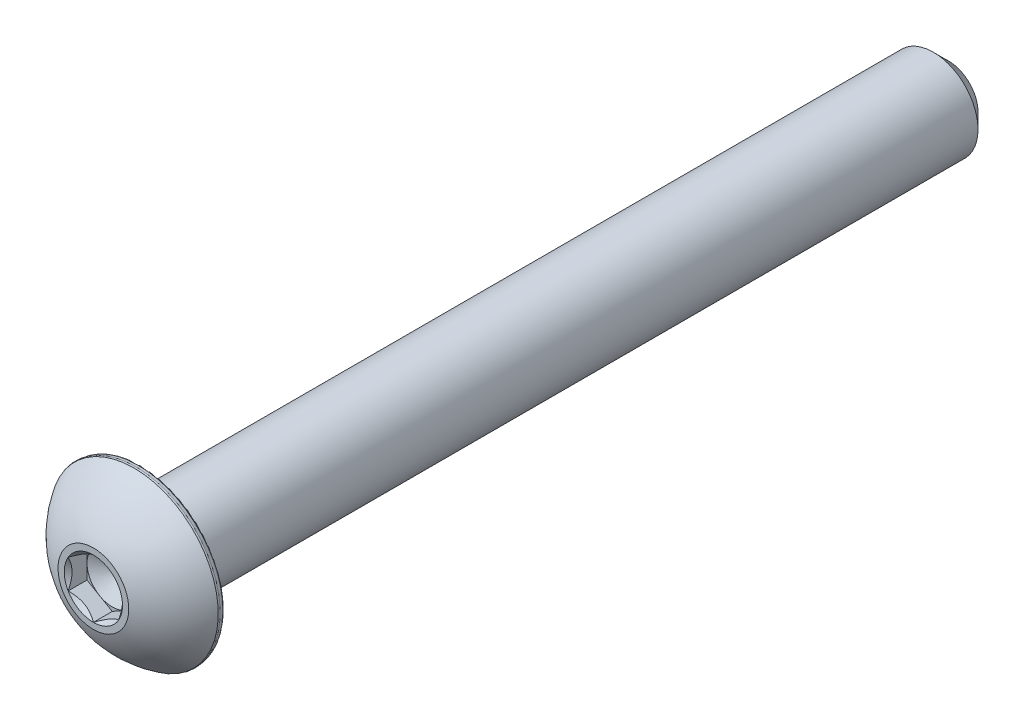
ISO-10303-21;
HEADER;
FILE_DESCRIPTION(('STEP AP214'),'2;1');
FILE_NAME('part.step','',(''),(''),'','','');
FILE_SCHEMA(('AUTOMOTIVE_DESIGN { 1 0 10303 214 1 1 1 1 }'));
ENDSEC;
DATA;
#1=APPLICATION_CONTEXT('core data for automotive mechanical design processes');
#2=APPLICATION_PROTOCOL_DEFINITION('international standard','automotive_design',2000,#1);
#3=PRODUCT_CONTEXT('',#1,'mechanical');
#4=PRODUCT('Part','Part','',(#3));
#5=PRODUCT_RELATED_PRODUCT_CATEGORY('part','',(#4));
#6=PRODUCT_DEFINITION_FORMATION('','',#4);
#7=PRODUCT_DEFINITION_CONTEXT('part definition',#1,'design');
#8=PRODUCT_DEFINITION('design','',#6,#7);
#9=PRODUCT_DEFINITION_SHAPE('','',#8);
#10=(LENGTH_UNIT() NAMED_UNIT(*) SI_UNIT(.MILLI.,.METRE.));
#11=(NAMED_UNIT(*) PLANE_ANGLE_UNIT() SI_UNIT($,.RADIAN.));
#12=(NAMED_UNIT(*) SI_UNIT($,.STERADIAN.) SOLID_ANGLE_UNIT());
#13=UNCERTAINTY_MEASURE_WITH_UNIT(LENGTH_MEASURE(1.E-05),#10,'distance_accuracy_value','');
#14=(GEOMETRIC_REPRESENTATION_CONTEXT(3) GLOBAL_UNCERTAINTY_ASSIGNED_CONTEXT((#13)) GLOBAL_UNIT_ASSIGNED_CONTEXT((#10,
#11,#12)) REPRESENTATION_CONTEXT('',''));
#15=CARTESIAN_POINT('',(0.,0.,0.));
#16=DIRECTION('',(0.,0.,1.));
#17=DIRECTION('',(1.,0.,0.));
#18=AXIS2_PLACEMENT_3D('',#15,#16,#17);
#19=CARTESIAN_POINT('',(0.,0.9921875,16.8021));
#20=DIRECTION('',(0.,0.,-1.));
#21=DIRECTION('',(-1.,0.,0.));
#22=AXIS2_PLACEMENT_3D('',#19,#20,#21);
#23=PLANE('',#22);
#24=CARTESIAN_POINT('',(0.,0.,16.8021));
#25=DIRECTION('',(0.,0.,1.));
#26=DIRECTION('',(1.,0.,0.));
#27=AXIS2_PLACEMENT_3D('',#24,#25,#26);
#28=CIRCLE('',#27,1.3890625);
#29=CARTESIAN_POINT('',(0.,1.3890625,16.8021));
#30=VERTEX_POINT('',#29);
#31=EDGE_CURVE('E173',#30,#30,#28,.T.);
#32=ORIENTED_EDGE('',*,*,#31,.T.);
#33=EDGE_LOOP('',(#32));
#34=FACE_BOUND('',#33,.T.);
#35=CARTESIAN_POINT('',(0.,0.,16.8021));
#36=DIRECTION('',(0.,0.,1.));
#37=DIRECTION('',(1.,0.,0.));
#38=AXIS2_PLACEMENT_3D('',#35,#36,#37);
#39=CIRCLE('',#38,1.14567944042316);
#40=CARTESIAN_POINT('',(0.,1.14567944042316,16.8021));
#41=VERTEX_POINT('',#40);
#42=CARTESIAN_POINT('',(-0.992187500000001,0.57283972021158,16.8021));
#43=VERTEX_POINT('',#42);
#44=EDGE_CURVE('E127',#41,#43,#39,.T.);
#45=ORIENTED_EDGE('',*,*,#44,.F.);
#46=CARTESIAN_POINT('',(0.,0.,16.8021));
#47=DIRECTION('',(0.,0.,1.));
#48=DIRECTION('',(1.,0.,0.));
#49=AXIS2_PLACEMENT_3D('',#46,#47,#48);
#50=CIRCLE('',#49,1.14567944042316);
#51=CARTESIAN_POINT('',(0.9921875,0.572839720211582,16.8021));
#52=VERTEX_POINT('',#51);
#53=EDGE_CURVE('E112',#52,#41,#50,.T.);
#54=ORIENTED_EDGE('',*,*,#53,.F.);
#55=CARTESIAN_POINT('',(0.,0.,16.8021));
#56=DIRECTION('',(0.,0.,1.));
#57=DIRECTION('',(1.,0.,0.));
#58=AXIS2_PLACEMENT_3D('',#55,#56,#57);
#59=CIRCLE('',#58,1.14567944042316);
#60=CARTESIAN_POINT('',(0.9921875,-0.572839720211582,16.8021));
#61=VERTEX_POINT('',#60);
#62=EDGE_CURVE('E123',#61,#52,#59,.T.);
#63=ORIENTED_EDGE('',*,*,#62,.F.);
#64=CARTESIAN_POINT('',(0.,0.,16.8021));
#65=DIRECTION('',(0.,0.,1.));
#66=DIRECTION('',(1.,0.,0.));
#67=AXIS2_PLACEMENT_3D('',#64,#65,#66);
#68=CIRCLE('',#67,1.14567944042316);
#69=CARTESIAN_POINT('',(0.,-1.14567944042316,16.8021));
#70=VERTEX_POINT('',#69);
#71=EDGE_CURVE('E144',#70,#61,#68,.T.);
#72=ORIENTED_EDGE('',*,*,#71,.F.);
#73=CARTESIAN_POINT('',(0.,0.,16.8021));
#74=DIRECTION('',(0.,0.,1.));
#75=DIRECTION('',(1.,0.,0.));
#76=AXIS2_PLACEMENT_3D('',#73,#74,#75);
#77=CIRCLE('',#76,1.14567944042316);
#78=CARTESIAN_POINT('',(-0.9921875,-0.572839720211582,16.8021));
#79=VERTEX_POINT('',#78);
#80=EDGE_CURVE('E490',#79,#70,#77,.T.);
#81=ORIENTED_EDGE('',*,*,#80,.F.);
#82=CARTESIAN_POINT('',(0.,0.,16.8021));
#83=DIRECTION('',(0.,0.,1.));
#84=DIRECTION('',(1.,0.,0.));
#85=AXIS2_PLACEMENT_3D('',#82,#83,#84);
#86=CIRCLE('',#85,1.14567944042316);
#87=EDGE_CURVE('E290',#43,#79,#86,.T.);
#88=ORIENTED_EDGE('',*,*,#87,.F.);
#89=EDGE_LOOP('',(#45,#54,#63,#72,#81,#88));
#90=FACE_BOUND('',#89,.T.);
#91=ADVANCED_FACE('F39',(#34,#90),#23,.F.);
#92=CARTESIAN_POINT('',(0.,0.,-16.8021));
#93=DIRECTION('',(0.,0.,1.));
#94=DIRECTION('',(1.,0.,0.));
#95=AXIS2_PLACEMENT_3D('',#92,#93,#94);
#96=CONICAL_SURFACE('',#95,1.1572875,0.785398163397447);
#97=CARTESIAN_POINT('',(0.,0.,-16.2067875));
#98=DIRECTION('',(0.,0.,1.));
#99=DIRECTION('',(1.,0.,0.));
#100=AXIS2_PLACEMENT_3D('',#97,#98,#99);
#101=CIRCLE('',#100,1.7526);
#102=CARTESIAN_POINT('',(1.7526,0.,-16.2067875));
#103=VERTEX_POINT('',#102);
#104=EDGE_CURVE('E180',#103,#103,#101,.T.);
#105=ORIENTED_EDGE('',*,*,#104,.F.);
#106=EDGE_LOOP('',(#105));
#107=FACE_BOUND('',#106,.T.);
#108=CARTESIAN_POINT('',(0.,0.,-16.8021));
#109=DIRECTION('',(0.,0.,1.));
#110=DIRECTION('',(1.,0.,0.));
#111=AXIS2_PLACEMENT_3D('',#108,#109,#110);
#112=CIRCLE('',#111,1.1572875);
#113=CARTESIAN_POINT('',(1.1572875,0.,-16.8021));
#114=VERTEX_POINT('',#113);
#115=EDGE_CURVE('E166',#114,#114,#112,.T.);
#116=ORIENTED_EDGE('',*,*,#115,.T.);
#117=EDGE_LOOP('',(#116));
#118=FACE_BOUND('',#117,.T.);
#119=ADVANCED_FACE('F217',(#107,#118),#96,.T.);
#120=CARTESIAN_POINT('',(0.,0.,16.8021));
#121=DIRECTION('',(0.,0.,1.));
#122=DIRECTION('',(1.,0.,0.));
#123=AXIS2_PLACEMENT_3D('',#120,#121,#122);
#124=CYLINDRICAL_SURFACE('',#123,1.7526);
#125=CARTESIAN_POINT('',(0.,0.,14.9479));
#126=DIRECTION('',(0.,0.,1.));
#127=DIRECTION('',(1.,0.,0.));
#128=AXIS2_PLACEMENT_3D('',#125,#126,#127);
#129=CIRCLE('',#128,1.7526);
#130=CARTESIAN_POINT('',(1.7526,0.,14.9479));
#131=VERTEX_POINT('',#130);
#132=EDGE_CURVE('E177',#131,#131,#129,.T.);
#133=ORIENTED_EDGE('',*,*,#132,.F.);
#134=EDGE_LOOP('',(#133));
#135=FACE_BOUND('',#134,.T.);
#136=ORIENTED_EDGE('',*,*,#104,.T.);
#137=EDGE_LOOP('',(#136));
#138=FACE_BOUND('',#137,.T.);
#139=ADVANCED_FACE('F224',(#135,#138),#124,.T.);
#140=CARTESIAN_POINT('',(0.,3.28741155973219,14.9479));
#141=DIRECTION('',(0.,0.,1.));
#142=DIRECTION('',(1.,0.,0.));
#143=AXIS2_PLACEMENT_3D('',#140,#141,#142);
#144=PLANE('',#143);
#145=CARTESIAN_POINT('',(0.,0.,14.9479));
#146=DIRECTION('',(0.,0.,1.));
#147=DIRECTION('',(1.,0.,0.));
#148=AXIS2_PLACEMENT_3D('',#145,#146,#147);
#149=CIRCLE('',#148,3.20961863292574);
#150=CARTESIAN_POINT('',(3.20961863292574,0.,14.9479));
#151=VERTEX_POINT('',#150);
#152=EDGE_CURVE('E47',#151,#151,#149,.F.);
#153=ORIENTED_EDGE('',*,*,#152,.T.);
#154=EDGE_LOOP('',(#153));
#155=FACE_BOUND('',#154,.T.);
#156=ORIENTED_EDGE('',*,*,#132,.T.);
#157=EDGE_LOOP('',(#156));
#158=FACE_BOUND('',#157,.T.);
#159=ADVANCED_FACE('F191',(#155,#158),#144,.F.);
#160=CARTESIAN_POINT('',(0.,0.,14.9479));
#161=DIRECTION('',(0.,0.,1.));
#162=DIRECTION('',(1.,0.,0.));
#163=AXIS2_PLACEMENT_3D('',#160,#161,#162);
#164=CONICAL_SURFACE('',#163,3.28741155973219,0.174532925199426);
#165=CARTESIAN_POINT('',(0.,0.,15.0245110774485));
#166=DIRECTION('',(0.,0.,-1.));
#167=DIRECTION('',(-1.,0.,0.));
#168=AXIS2_PLACEMENT_3D('',#165,#166,#167);
#169=CIRCLE('',#168,3.30092015970751);
#170=CARTESIAN_POINT('',(-3.30092015970751,0.,15.0245110774485));
#171=VERTEX_POINT('',#170);
#172=EDGE_CURVE('E186',#171,#171,#169,.F.);
#173=ORIENTED_EDGE('',*,*,#172,.T.);
#174=EDGE_LOOP('',(#173));
#175=FACE_BOUND('',#174,.T.);
#176=CARTESIAN_POINT('',(0.,0.,15.140362863037));
#177=DIRECTION('',(0.,0.,-1.));
#178=DIRECTION('',(-1.,0.,0.));
#179=AXIS2_PLACEMENT_3D('',#176,#177,#178);
#180=CIRCLE('',#179,3.32134795527);
#181=CARTESIAN_POINT('',(-3.32134795527,0.,15.140362863037));
#182=VERTEX_POINT('',#181);
#183=EDGE_CURVE('E183',#182,#182,#180,.T.);
#184=ORIENTED_EDGE('',*,*,#183,.T.);
#185=EDGE_LOOP('',(#184));
#186=FACE_BOUND('',#185,.T.);
#187=ADVANCED_FACE('F199',(#175,#186),#164,.T.);
#188=CARTESIAN_POINT('',(0.,0.,13.1796132454163));
#189=DIRECTION('',(0.,0.,1.));
#190=DIRECTION('',(0.,1.,0.));
#191=AXIS2_PLACEMENT_3D('',#188,#189,#190);
#192=SPHERICAL_SURFACE('',#191,3.87967845523838);
#193=CARTESIAN_POINT('',(0.,0.,15.204857654296));
#194=DIRECTION('',(0.,0.,-1.));
#195=DIRECTION('',(-1.,0.,0.));
#196=AXIS2_PLACEMENT_3D('',#193,#194,#195);
#197=CIRCLE('',#196,3.30912224016312);
#198=CARTESIAN_POINT('',(0.,3.30912224016311,15.204857654296));
#199=VERTEX_POINT('',#198);
#200=EDGE_CURVE('E11',#199,#199,#197,.F.);
#201=CARTESIAN_POINT('',(0.,3.30912224016311,15.204857654296));
#202=CARTESIAN_POINT('',(0.,3.29529526830407,15.2274501366691));
#203=CARTESIAN_POINT('',(0.,3.28123685957302,15.2499009736687));
#204=CARTESIAN_POINT('',(0.,3.25266321696502,15.2945100356743));
#205=CARTESIAN_POINT('',(0.,3.23814798308807,15.3166682606802));
#206=CARTESIAN_POINT('',(0.,3.2086667387864,15.3606827774513));
#207=CARTESIAN_POINT('',(0.,3.19370072836166,15.3825390692165));
#208=CARTESIAN_POINT('',(0.,3.16332422001081,15.4259405578101));
#209=CARTESIAN_POINT('',(0.,3.14791372208469,15.4474857546385));
#210=CARTESIAN_POINT('',(0.,3.11665470047967,15.4902560133525));
#211=CARTESIAN_POINT('',(0.,3.10080617680078,15.5114810752381));
#212=CARTESIAN_POINT('',(0.,3.06867775287599,15.5536021607178));
#213=CARTESIAN_POINT('',(0.,3.05239785263009,15.574498184312));
#214=CARTESIAN_POINT('',(0.,3.01941350473032,15.6159524272577));
#215=CARTESIAN_POINT('',(0.,3.00270905707646,15.6365106466093));
#216=CARTESIAN_POINT('',(0.,2.96888262188085,15.6772806569965));
#217=CARTESIAN_POINT('',(0.,2.95176063433909,15.697492448032));
#218=CARTESIAN_POINT('',(0.,2.91710630197352,15.7375611229935));
#219=CARTESIAN_POINT('',(0.,2.89957395714971,15.7574180069194));
#220=CARTESIAN_POINT('',(0.,2.86410626498847,15.796768537763));
#221=CARTESIAN_POINT('',(0.,2.84617091765105,15.8162621846806));
#222=CARTESIAN_POINT('',(0.,2.80990474428426,15.8548780639822));
#223=CARTESIAN_POINT('',(0.,2.79157391825489,15.8740002963661));
#224=CARTESIAN_POINT('',(0.,2.75452447722933,15.9118653248832));
#225=CARTESIAN_POINT('',(0.,2.73580586223313,15.9306081210163));
#226=CARTESIAN_POINT('',(0.,2.69798869567494,15.9677064144867));
#227=CARTESIAN_POINT('',(0.,2.67889014411294,15.986061911824));
#228=CARTESIAN_POINT('',(0.,2.64032111620648,16.0223779076283));
#229=CARTESIAN_POINT('',(0.,2.62085063986202,16.0403384060953));
#230=CARTESIAN_POINT('',(0.,2.58154593019523,16.0758568697855));
#231=CARTESIAN_POINT('',(0.,2.56171169687291,16.0934148350087));
#232=CARTESIAN_POINT('',(0.,2.52168779364995,16.1281208666993));
#233=CARTESIAN_POINT('',(0.,2.50149812374931,16.1452689331666));
#234=CARTESIAN_POINT('',(0.,2.46077181687379,16.1791479737844));
#235=CARTESIAN_POINT('',(0.,2.44023517989892,16.195878947935));
#236=CARTESIAN_POINT('',(0.,2.39882355393063,16.2289167853274));
#237=CARTESIAN_POINT('',(0.,2.37794856493723,16.2452236485693));
#238=CARTESIAN_POINT('',(0.,2.3358689919252,16.2774064234657));
#239=CARTESIAN_POINT('',(0.,2.31466440790658,16.2932823351202));
#240=CARTESIAN_POINT('',(0.,2.27193454010156,16.324596546946));
#241=CARTESIAN_POINT('',(0.,2.25040925631515,16.3400348471172));
#242=CARTESIAN_POINT('',(0.,2.20704701876452,16.3704673596574));
#243=CARTESIAN_POINT('',(0.,2.18521006500029,16.3854615720263));
#244=CARTESIAN_POINT('',(0.,2.14123364802863,16.414999618936));
#245=CARTESIAN_POINT('',(0.,2.11909418482119,16.4295434534768));
#246=CARTESIAN_POINT('',(0.,2.07452203639932,16.4581746436365));
#247=CARTESIAN_POINT('',(0.,2.05208935118488,16.4722619992554));
#248=CARTESIAN_POINT('',(0.,2.00694016919158,16.4999743219702));
#249=CARTESIAN_POINT('',(0.,1.9842236724127,16.5135992890662));
#250=CARTESIAN_POINT('',(0.,1.93851639678886,16.5403811190992));
#251=CARTESIAN_POINT('',(0.,1.91552561794389,16.5535379820363));
#252=CARTESIAN_POINT('',(0.,1.86927942275519,16.5793780845047));
#253=CARTESIAN_POINT('',(0.,1.84602400641147,16.5920613240361));
#254=CARTESIAN_POINT('',(0.,1.79925829177545,16.6169488590519));
#255=CARTESIAN_POINT('',(0.,1.77574799348315,16.6291531545362));
#256=CARTESIAN_POINT('',(0.,1.7284823775409,16.6530776820234));
#257=CARTESIAN_POINT('',(0.,1.70472705989094,16.6647979140262));
#258=CARTESIAN_POINT('',(0.,1.65698137016677,16.6877493970921));
#259=CARTESIAN_POINT('',(0.,1.63299099809256,16.6989806481553));
#260=CARTESIAN_POINT('',(0.,1.58478526470882,16.7209494610651));
#261=CARTESIAN_POINT('',(0.,1.56056990339929,16.7316870229116));
#262=CARTESIAN_POINT('',(0.,1.5119243449548,16.7526639410789));
#263=CARTESIAN_POINT('',(0.,1.48749414781984,16.7629032973996));
#264=CARTESIAN_POINT('',(0.,1.43842918425175,16.7828795536797));
#265=CARTESIAN_POINT('',(0.,1.41379441781861,16.792616453639));
#266=CARTESIAN_POINT('',(0.,1.3890625,16.8021));
#267=B_SPLINE_CURVE_WITH_KNOTS('',3,(#201,#202,#203,#204,#205,#206,#207,#208,#209,#210,#211,
#212,#213,#214,#215,#216,#217,#218,#219,#220,#221,#222,#223,#224,#225,#226,#227,#228,#229,#230,
#231,#232,#233,#234,#235,#236,#237,#238,#239,#240,#241,#242,#243,#244,#245,#246,#247,#248,#249,
#250,#251,#252,#253,#254,#255,#256,#257,#258,#259,#260,#261,#262,#263,#264,#265,#266),
.UNSPECIFIED.,.F.,.F.,(4,2,2,2,2,2,2,2,2,2,2,2,2,2,2,2,2,2,2,2,2,2,2,2,2,2,2,2,2,2,2,2,4),(0.,
0.0794621140090885,0.158924228018176,0.238386342027264,0.317848456036352,0.39731057004544,
0.476772684054528,0.556234798063618,0.635696912072705,0.715159026081794,0.794621140090881,
0.87408325409997,0.953545368109059,1.03300748211815,1.11246959612724,1.19193171013632,
1.27139382414541,1.3508559381545,1.43031805216359,1.50978016617268,1.58924228018177,
1.66870439419085,1.74816650819994,1.82762862220903,1.90709073621812,1.98655285022721,
2.06601496423629,2.14547707824538,2.22493919225447,2.30440130626356,2.38386342027265,
2.46332553428174,2.54278764829082),.UNSPECIFIED.);
#268=EDGE_CURVE('BSEAM202',#199,#30,#267,.T.);
#269=ORIENTED_EDGE('',*,*,#200,.T.);
#270=ORIENTED_EDGE('',*,*,#31,.F.);
#271=ORIENTED_EDGE('',*,*,#268,.T.);
#272=ORIENTED_EDGE('',*,*,#268,.F.);
#273=EDGE_LOOP('',(#269,#271,#270,#272));
#274=FACE_BOUND('',#273,.T.);
#275=ADVANCED_FACE('F202',(#274),#192,.T.);
#276=CARTESIAN_POINT('',(0.,1.1572875,-16.8021));
#277=DIRECTION('',(0.,0.,1.));
#278=DIRECTION('',(1.,0.,0.));
#279=AXIS2_PLACEMENT_3D('',#276,#277,#278);
#280=PLANE('',#279);
#281=ORIENTED_EDGE('',*,*,#115,.F.);
#282=EDGE_LOOP('',(#281));
#283=FACE_BOUND('',#282,.T.);
#284=ADVANCED_FACE('F212',(#283),#280,.F.);
#285=CARTESIAN_POINT('',(0.9921875,0.572839720211583,16.8021));
#286=DIRECTION('',(-0.5,-0.866025403784439,0.));
#287=DIRECTION('',(0.866025403784439,-0.5,0.));
#288=AXIS2_PLACEMENT_3D('',#285,#286,#287);
#289=PLANE('',#288);
#290=CARTESIAN_POINT('',(0.9923875,0.572724250157745,16.802215487509));
#291=CARTESIAN_POINT('',(0.958273424767843,0.592420020676185,16.7825328114047));
#292=CARTESIAN_POINT('',(0.923588910507719,0.612445134320979,16.7640056845184));
#293=CARTESIAN_POINT('',(0.852862918800039,0.653278804672111,16.7300823296504));
#294=CARTESIAN_POINT('',(0.816814708375756,0.674091248664375,16.7147049872309));
#295=CARTESIAN_POINT('',(0.744124988262603,0.716058678139023,16.6883631427343));
#296=CARTESIAN_POINT('',(0.707502010986797,0.737202963927735,16.6773323965131));
#297=CARTESIAN_POINT('',(0.633449993753942,0.779956916011159,16.6603362056729));
#298=CARTESIAN_POINT('',(0.596023217440656,0.801565275390534,16.6543580675789));
#299=CARTESIAN_POINT('',(0.531522861394528,0.838804573316593,16.6489663449143));
#300=CARTESIAN_POINT('',(0.504533200685469,0.854387061192305,16.6481689963883));
#301=CARTESIAN_POINT('',(0.450606144054334,0.885521861854895,16.6495081933614));
#302=CARTESIAN_POINT('',(0.423668760975759,0.901074167226574,16.651645386137));
#303=CARTESIAN_POINT('',(0.343241277041501,0.947508996726262,16.662317571306));
#304=CARTESIAN_POINT('',(0.290151430636716,0.978160433839301,16.6751143807227));
#305=CARTESIAN_POINT('',(0.196972862034201,1.03195710550467,16.7059974676501));
#306=CARTESIAN_POINT('',(0.156447193690482,1.055354611032,16.7224650089077));
#307=CARTESIAN_POINT('',(0.0769831842917915,1.10123317824922,16.7595603835568));
#308=CARTESIAN_POINT('',(0.0380401617384755,1.12371694280344,16.7801746806455));
#309=CARTESIAN_POINT('',(-0.00020000000000031,1.145794910477,16.802215487509));
#310=B_SPLINE_CURVE_WITH_KNOTS('',3,(#290,#291,#292,#293,#294,#295,#296,#297,#298,#299,#300,
#301,#302,#303,#304,#305,#306,#307,#308,#309),.UNSPECIFIED.,.F.,.F.,(4,2,2,2,2,2,2,2,2,4),(0.,
0.132197185210191,0.265165186853264,0.396020097605671,0.526545281028575,0.619935205043266,
0.713345731536166,0.900220051846371,1.04884529769095,1.1969930355767),.UNSPECIFIED.);
#311=EDGE_CURVE('E109',#52,#41,#310,.T.);
#312=ORIENTED_EDGE('',*,*,#311,.T.);
#313=DIRECTION('',(0.,0.,-1.));
#314=VECTOR('',#313,1.);
#315=CARTESIAN_POINT('',(0.,1.14567944042316,16.8021));
#316=LINE('',#315,#314);
#317=CARTESIAN_POINT('',(0.,1.14567944042316,16.06042));
#318=VERTEX_POINT('',#317);
#319=EDGE_CURVE('E164',#41,#318,#316,.T.);
#320=ORIENTED_EDGE('',*,*,#319,.T.);
#321=DIRECTION('',(-0.866025403784439,0.5,0.));
#322=VECTOR('',#321,1.);
#323=CARTESIAN_POINT('',(0.9921875,0.572839720211583,16.06042));
#324=LINE('',#323,#322);
#325=CARTESIAN_POINT('',(0.496093749999999,0.859259580317373,16.06042));
#326=VERTEX_POINT('',#325);
#327=EDGE_CURVE('E293',#326,#318,#324,.T.);
#328=ORIENTED_EDGE('',*,*,#327,.F.);
#329=CARTESIAN_POINT('',(0.9921875,0.572839720211583,16.06042));
#330=VERTEX_POINT('',#329);
#331=EDGE_CURVE('E54',#330,#326,#324,.T.);
#332=ORIENTED_EDGE('',*,*,#331,.F.);
#333=DIRECTION('',(0.,0.,-1.));
#334=VECTOR('',#333,1.);
#335=CARTESIAN_POINT('',(0.9921875,0.572839720211583,16.8021));
#336=LINE('',#335,#334);
#337=EDGE_CURVE('E140',#52,#330,#336,.T.);
#338=ORIENTED_EDGE('',*,*,#337,.F.);
#339=EDGE_LOOP('',(#312,#320,#328,#332,#338));
#340=FACE_BOUND('',#339,.T.);
#341=ADVANCED_FACE('F146',(#340),#289,.T.);
#342=CARTESIAN_POINT('',(0.,1.14567944042316,16.8021));
#343=DIRECTION('',(0.500000000000001,-0.866025403784438,0.));
#344=DIRECTION('',(0.866025403784438,0.500000000000001,0.));
#345=AXIS2_PLACEMENT_3D('',#342,#343,#344);
#346=PLANE('',#345);
#347=CARTESIAN_POINT('',(0.000199999999999419,1.145794910477,16.802215487509));
#348=CARTESIAN_POINT('',(-0.0339140752321571,1.12609913995856,16.7825328114047));
#349=CARTESIAN_POINT('',(-0.068598589492281,1.10607402631377,16.7640056845184));
#350=CARTESIAN_POINT('',(-0.139324581199961,1.06524035596263,16.7300823296504));
#351=CARTESIAN_POINT('',(-0.175372791624244,1.04442791197037,16.7147049872309));
#352=CARTESIAN_POINT('',(-0.248062511737397,1.00246048249572,16.6883631427343));
#353=CARTESIAN_POINT('',(-0.284685489013203,0.981316196707011,16.6773323965131));
#354=CARTESIAN_POINT('',(-0.358737506246058,0.938562244623587,16.6603362056729));
#355=CARTESIAN_POINT('',(-0.396164282559344,0.916953885244212,16.6543580675789));
#356=CARTESIAN_POINT('',(-0.460664638605472,0.879714587318153,16.6489663449143));
#357=CARTESIAN_POINT('',(-0.487654299314531,0.864132099442441,16.6481689963883));
#358=CARTESIAN_POINT('',(-0.541581355945666,0.832997298779851,16.6495081933614));
#359=CARTESIAN_POINT('',(-0.568518739024241,0.817444993408172,16.651645386137));
#360=CARTESIAN_POINT('',(-0.648946222958499,0.771010163908484,16.662317571306));
#361=CARTESIAN_POINT('',(-0.702036069363284,0.740358726795445,16.6751143807227));
#362=CARTESIAN_POINT('',(-0.795214637965798,0.686562055130079,16.7059974676501));
#363=CARTESIAN_POINT('',(-0.835740306309517,0.663164549602743,16.7224650089077));
#364=CARTESIAN_POINT('',(-0.915204315708208,0.617285982385522,16.7595603835568));
#365=CARTESIAN_POINT('',(-0.954147338261524,0.594802217831307,16.7801746806455));
#366=CARTESIAN_POINT('',(-0.9923875,0.572724250157743,16.802215487509));
#367=B_SPLINE_CURVE_WITH_KNOTS('',3,(#347,#348,#349,#350,#351,#352,#353,#354,#355,#356,#357,
#358,#359,#360,#361,#362,#363,#364,#365,#366),.UNSPECIFIED.,.F.,.F.,(4,2,2,2,2,2,2,2,2,4),(0.,
0.132197185210191,0.265165186853264,0.396020097605672,0.526545281028575,0.619935205043266,
0.713345731536166,0.900220051846371,1.04884529769095,1.1969930355767),.UNSPECIFIED.);
#368=EDGE_CURVE('E281',#41,#43,#367,.T.);
#369=ORIENTED_EDGE('',*,*,#368,.T.);
#370=DIRECTION('',(0.,0.,-1.));
#371=VECTOR('',#370,1.);
#372=CARTESIAN_POINT('',(-0.992187500000001,0.572839720211581,16.8021));
#373=LINE('',#372,#371);
#374=CARTESIAN_POINT('',(-0.992187500000001,0.572839720211581,16.06042));
#375=VERTEX_POINT('',#374);
#376=EDGE_CURVE('E161',#43,#375,#373,.T.);
#377=ORIENTED_EDGE('',*,*,#376,.T.);
#378=DIRECTION('',(-0.866025403784438,-0.500000000000001,0.));
#379=VECTOR('',#378,1.);
#380=CARTESIAN_POINT('',(0.,1.14567944042316,16.06042));
#381=LINE('',#380,#379);
#382=CARTESIAN_POINT('',(-0.496093750000001,0.859259580317373,16.06042));
#383=VERTEX_POINT('',#382);
#384=EDGE_CURVE('E295',#383,#375,#381,.T.);
#385=ORIENTED_EDGE('',*,*,#384,.F.);
#386=EDGE_CURVE('E296',#318,#383,#381,.T.);
#387=ORIENTED_EDGE('',*,*,#386,.F.);
#388=ORIENTED_EDGE('',*,*,#319,.F.);
#389=EDGE_LOOP('',(#369,#377,#385,#387,#388));
#390=FACE_BOUND('',#389,.T.);
#391=ADVANCED_FACE('F247',(#390),#346,.T.);
#392=CARTESIAN_POINT('',(-0.992187500000001,0.572839720211581,16.8021));
#393=DIRECTION('',(1.,0.,0.));
#394=DIRECTION('',(0.,1.,0.));
#395=AXIS2_PLACEMENT_3D('',#392,#393,#394);
#396=PLANE('',#395);
#397=CARTESIAN_POINT('',(-0.9921875,-1.10949418891906,17.1448470409327));
#398=CARTESIAN_POINT('',(-0.9921875,-1.08232486488861,17.1245977650143));
#399=CARTESIAN_POINT('',(-0.9921875,-1.0550006408226,17.1045568710457));
#400=CARTESIAN_POINT('',(-0.9921875,-0.999980792873916,17.0649768868049));
#401=CARTESIAN_POINT('',(-0.9921875,-0.972285074627782,17.0454379278497));
#402=CARTESIAN_POINT('',(-0.9921875,-0.888143426458249,16.9874234554565));
#403=CARTESIAN_POINT('',(-0.9921875,-0.831056182145671,16.9498623928985));
#404=CARTESIAN_POINT('',(-0.9921875,-0.711554440354378,16.8764195358545));
#405=CARTESIAN_POINT('',(-0.9921875,-0.649018130618405,16.8407335899983));
#406=CARTESIAN_POINT('',(-0.9921875,-0.520865585622981,16.7756639049752));
#407=CARTESIAN_POINT('',(-0.9921875,-0.455260644614129,16.7462589787957));
#408=CARTESIAN_POINT('',(-0.9921875,-0.356464487367681,16.7102954983595));
#409=CARTESIAN_POINT('',(-0.9921875,-0.324666846387042,16.6999208050058));
#410=CARTESIAN_POINT('',(-0.9921875,-0.26033277698824,16.6817288358135));
#411=CARTESIAN_POINT('',(-0.9921875,-0.227796295081891,16.6739117457672));
#412=CARTESIAN_POINT('',(-0.9921875,-0.162712405358302,16.6613637547531));
#413=CARTESIAN_POINT('',(-0.9921875,-0.130175055255581,16.6565814793169));
#414=CARTESIAN_POINT('',(-0.9921875,-0.0647778707960083,16.6501881200598));
#415=CARTESIAN_POINT('',(-0.992187500000001,-0.0319179811139633,16.6485775901906));
#416=CARTESIAN_POINT('',(-0.992187500000001,0.0327400524007129,16.6486384241559));
#417=CARTESIAN_POINT('',(-0.992187500000001,0.0645383411726866,16.6502058628384));
#418=CARTESIAN_POINT('',(-0.992187500000001,0.127849181023788,16.6563145432134));
#419=CARTESIAN_POINT('',(-0.992187500000001,0.159361674088217,16.6608563755709));
#420=CARTESIAN_POINT('',(-0.992187500000001,0.222401055147186,16.6727486114099));
#421=CARTESIAN_POINT('',(-0.992187500000001,0.253919030493481,16.6801455740016));
#422=CARTESIAN_POINT('',(-0.992187500000001,0.316270119305015,16.6973649633627));
#423=CARTESIAN_POINT('',(-0.992187500000001,0.347103300686063,16.7071871484245));
#424=CARTESIAN_POINT('',(-0.992187500000001,0.44574734841867,16.742264086148));
#425=CARTESIAN_POINT('',(-0.992187500000001,0.512111869884735,16.7715775702976));
#426=CARTESIAN_POINT('',(-0.992187500000001,0.641707751633626,16.8367033241341));
#427=CARTESIAN_POINT('',(-0.992187500000001,0.704926593628333,16.872539267595));
#428=CARTESIAN_POINT('',(-0.992187500000001,0.825720927781169,16.9464181448275));
#429=CARTESIAN_POINT('',(-0.992187500000001,0.883420488382574,16.9842606988511));
#430=CARTESIAN_POINT('',(-0.992187500000001,0.968430125783475,17.0427387372263));
#431=CARTESIAN_POINT('',(-0.992187500000001,0.996398939377163,17.0624332531538));
#432=CARTESIAN_POINT('',(-0.992187500000001,1.05195567836533,17.1023371742085));
#433=CARTESIAN_POINT('',(-0.992187500000001,1.07954370555034,17.1225464374577));
#434=CARTESIAN_POINT('',(-0.992187500000001,1.10697339818653,17.1429689575272));
#435=B_SPLINE_CURVE_WITH_KNOTS('',3,(#397,#398,#399,#400,#401,#402,#403,#404,#405,#406,#407,
#408,#409,#410,#411,#412,#413,#414,#415,#416,#417,#418,#419,#420,#421,#422,#423,#424,#425,#426,
#427,#428,#429,#430,#431,#432,#433,#434),.UNSPECIFIED.,.F.,.F.,(4,2,2,2,2,2,2,2,2,2,2,2,2,2,2,2,
2,2,4),(0.,0.101652856174559,0.203332041530399,0.408242719174562,0.62406203502054,
0.839141436739499,0.939397795991986,1.0396614365623,1.1381790118448,1.23671379188979,
1.332078293144,1.42746173794517,1.52447122946096,1.62147105651117,1.83847882513563,
2.05629054399461,2.26319512011788,2.36581270183829,2.46840229912002),.UNSPECIFIED.);
#436=EDGE_CURVE('E289',#43,#79,#435,.F.);
#437=ORIENTED_EDGE('',*,*,#436,.T.);
#438=DIRECTION('',(0.,0.,-1.));
#439=VECTOR('',#438,1.);
#440=CARTESIAN_POINT('',(-0.9921875,-0.572839720211582,16.8021));
#441=LINE('',#440,#439);
#442=CARTESIAN_POINT('',(-0.9921875,-0.572839720211582,16.06042));
#443=VERTEX_POINT('',#442);
#444=EDGE_CURVE('E158',#79,#443,#441,.T.);
#445=ORIENTED_EDGE('',*,*,#444,.T.);
#446=DIRECTION('',(0.,-1.,0.));
#447=VECTOR('',#446,1.);
#448=CARTESIAN_POINT('',(-0.992187500000001,0.572839720211581,16.06042));
#449=LINE('',#448,#447);
#450=CARTESIAN_POINT('',(-0.992187500000001,0.,16.06042));
#451=VERTEX_POINT('',#450);
#452=EDGE_CURVE('E299',#451,#443,#449,.T.);
#453=ORIENTED_EDGE('',*,*,#452,.F.);
#454=EDGE_CURVE('E300',#375,#451,#449,.T.);
#455=ORIENTED_EDGE('',*,*,#454,.F.);
#456=ORIENTED_EDGE('',*,*,#376,.F.);
#457=EDGE_LOOP('',(#437,#445,#453,#455,#456));
#458=FACE_BOUND('',#457,.T.);
#459=ADVANCED_FACE('F252',(#458),#396,.T.);
#460=CARTESIAN_POINT('',(-0.9921875,-0.572839720211582,16.8021));
#461=DIRECTION('',(0.499999999999999,0.866025403784439,0.));
#462=DIRECTION('',(-0.866025403784439,0.499999999999999,0.));
#463=AXIS2_PLACEMENT_3D('',#460,#461,#462);
#464=PLANE('',#463);
#465=CARTESIAN_POINT('',(-0.9923875,-0.572724250157744,16.802215487509));
#466=CARTESIAN_POINT('',(-0.958273424767844,-0.592420020676184,16.7825328114047));
#467=CARTESIAN_POINT('',(-0.923588910507721,-0.612445134320978,16.7640056845184));
#468=CARTESIAN_POINT('',(-0.852862918800041,-0.65327880467211,16.7300823296504));
#469=CARTESIAN_POINT('',(-0.816814708375757,-0.674091248664375,16.7147049872309));
#470=CARTESIAN_POINT('',(-0.744124988262603,-0.716058678139023,16.6883631427343));
#471=CARTESIAN_POINT('',(-0.707502010986797,-0.737202963927735,16.6773323965131));
#472=CARTESIAN_POINT('',(-0.633449993753941,-0.779956916011158,16.6603362056729));
#473=CARTESIAN_POINT('',(-0.596023217440655,-0.801565275390534,16.6543580675789));
#474=CARTESIAN_POINT('',(-0.531522861394527,-0.838804573316593,16.6489663449143));
#475=CARTESIAN_POINT('',(-0.504533200685468,-0.854387061192305,16.6481689963883));
#476=CARTESIAN_POINT('',(-0.450606144054333,-0.885521861854895,16.6495081933614));
#477=CARTESIAN_POINT('',(-0.423668760975758,-0.901074167226574,16.651645386137));
#478=CARTESIAN_POINT('',(-0.3432412770415,-0.947508996726262,16.662317571306));
#479=CARTESIAN_POINT('',(-0.290151430636715,-0.978160433839301,16.6751143807227));
#480=CARTESIAN_POINT('',(-0.1969728620342,-1.03195710550467,16.7059974676501));
#481=CARTESIAN_POINT('',(-0.156447193690481,-1.055354611032,16.7224650089077));
#482=CARTESIAN_POINT('',(-0.0769831842917907,-1.10123317824922,16.7595603835568));
#483=CARTESIAN_POINT('',(-0.0380401617384749,-1.12371694280344,16.7801746806455));
#484=CARTESIAN_POINT('',(0.000200000000000826,-1.145794910477,16.802215487509));
#485=B_SPLINE_CURVE_WITH_KNOTS('',3,(#465,#466,#467,#468,#469,#470,#471,#472,#473,#474,#475,
#476,#477,#478,#479,#480,#481,#482,#483,#484),.UNSPECIFIED.,.F.,.F.,(4,2,2,2,2,2,2,2,2,4),(0.,
0.13219718521019,0.265165186853265,0.396020097605673,0.526545281028578,0.619935205043268,
0.713345731536168,0.900220051846373,1.04884529769095,1.1969930355767),.UNSPECIFIED.);
#486=EDGE_CURVE('E492',#79,#70,#485,.T.);
#487=ORIENTED_EDGE('',*,*,#486,.T.);
#488=DIRECTION('',(0.,0.,-1.));
#489=VECTOR('',#488,1.);
#490=CARTESIAN_POINT('',(0.,-1.14567944042316,16.8021));
#491=LINE('',#490,#489);
#492=CARTESIAN_POINT('',(0.,-1.14567944042316,16.06042));
#493=VERTEX_POINT('',#492);
#494=EDGE_CURVE('E149',#70,#493,#491,.T.);
#495=ORIENTED_EDGE('',*,*,#494,.T.);
#496=DIRECTION('',(0.866025403784439,-0.499999999999999,0.));
#497=VECTOR('',#496,1.);
#498=CARTESIAN_POINT('',(-0.9921875,-0.572839720211582,16.06042));
#499=LINE('',#498,#497);
#500=CARTESIAN_POINT('',(-0.496093749999999,-0.859259580317373,16.06042));
#501=VERTEX_POINT('',#500);
#502=EDGE_CURVE('E303',#501,#493,#499,.T.);
#503=ORIENTED_EDGE('',*,*,#502,.F.);
#504=EDGE_CURVE('E304',#443,#501,#499,.T.);
#505=ORIENTED_EDGE('',*,*,#504,.F.);
#506=ORIENTED_EDGE('',*,*,#444,.F.);
#507=EDGE_LOOP('',(#487,#495,#503,#505,#506));
#508=FACE_BOUND('',#507,.T.);
#509=ADVANCED_FACE('F256',(#508),#464,.T.);
#510=CARTESIAN_POINT('',(0.,-1.14567944042316,16.8021));
#511=DIRECTION('',(-0.5,0.866025403784438,0.));
#512=DIRECTION('',(-0.866025403784438,-0.5,0.));
#513=AXIS2_PLACEMENT_3D('',#510,#511,#512);
#514=PLANE('',#513);
#515=CARTESIAN_POINT('',(-0.00019999999999954,-1.145794910477,16.802215487509));
#516=CARTESIAN_POINT('',(0.0339140752321561,-1.12609913995856,16.7825328114047));
#517=CARTESIAN_POINT('',(0.0685985894922793,-1.10607402631377,16.7640056845184));
#518=CARTESIAN_POINT('',(0.139324581199959,-1.06524035596264,16.7300823296504));
#519=CARTESIAN_POINT('',(0.175372791624243,-1.04442791197037,16.7147049872309));
#520=CARTESIAN_POINT('',(0.248062511737397,-1.00246048249572,16.6883631427343));
#521=CARTESIAN_POINT('',(0.284685489013202,-0.981316196707011,16.6773323965131));
#522=CARTESIAN_POINT('',(0.358737506246057,-0.938562244623587,16.6603362056729));
#523=CARTESIAN_POINT('',(0.396164282559343,-0.916953885244211,16.6543580675789));
#524=CARTESIAN_POINT('',(0.460664638605471,-0.879714587318153,16.6489663449143));
#525=CARTESIAN_POINT('',(0.48765429931453,-0.864132099442441,16.6481689963883));
#526=CARTESIAN_POINT('',(0.541581355945665,-0.832997298779851,16.6495081933614));
#527=CARTESIAN_POINT('',(0.56851873902424,-0.817444993408172,16.651645386137));
#528=CARTESIAN_POINT('',(0.648946222958498,-0.771010163908483,16.662317571306));
#529=CARTESIAN_POINT('',(0.702036069363283,-0.740358726795445,16.6751143807227));
#530=CARTESIAN_POINT('',(0.795214637965798,-0.686562055130079,16.7059974676501));
#531=CARTESIAN_POINT('',(0.835740306309517,-0.663164549602743,16.7224650089077));
#532=CARTESIAN_POINT('',(0.915204315708208,-0.617285982385522,16.7595603835568));
#533=CARTESIAN_POINT('',(0.954147338261524,-0.594802217831307,16.7801746806455));
#534=CARTESIAN_POINT('',(0.9923875,-0.572724250157743,16.802215487509));
#535=B_SPLINE_CURVE_WITH_KNOTS('',3,(#515,#516,#517,#518,#519,#520,#521,#522,#523,#524,#525,
#526,#527,#528,#529,#530,#531,#532,#533,#534),.UNSPECIFIED.,.F.,.F.,(4,2,2,2,2,2,2,2,2,4),(0.,
0.132197185210189,0.265165186853264,0.396020097605671,0.526545281028575,0.619935205043266,
0.713345731536165,0.900220051846371,1.04884529769095,1.1969930355767),.UNSPECIFIED.);
#536=EDGE_CURVE('E316',#70,#61,#535,.T.);
#537=ORIENTED_EDGE('',*,*,#536,.T.);
#538=DIRECTION('',(0.,0.,-1.));
#539=VECTOR('',#538,1.);
#540=CARTESIAN_POINT('',(0.9921875,-0.572839720211581,16.8021));
#541=LINE('',#540,#539);
#542=CARTESIAN_POINT('',(0.9921875,-0.572839720211581,16.06042));
#543=VERTEX_POINT('',#542);
#544=EDGE_CURVE('E143',#61,#543,#541,.T.);
#545=ORIENTED_EDGE('',*,*,#544,.T.);
#546=DIRECTION('',(0.866025403784438,0.5,0.));
#547=VECTOR('',#546,1.);
#548=CARTESIAN_POINT('',(0.,-1.14567944042316,16.06042));
#549=LINE('',#548,#547);
#550=CARTESIAN_POINT('',(0.49609375,-0.859259580317372,16.06042));
#551=VERTEX_POINT('',#550);
#552=EDGE_CURVE('E306',#551,#543,#549,.T.);
#553=ORIENTED_EDGE('',*,*,#552,.F.);
#554=EDGE_CURVE('E307',#493,#551,#549,.T.);
#555=ORIENTED_EDGE('',*,*,#554,.F.);
#556=ORIENTED_EDGE('',*,*,#494,.F.);
#557=EDGE_LOOP('',(#537,#545,#553,#555,#556));
#558=FACE_BOUND('',#557,.T.);
#559=ADVANCED_FACE('F260',(#558),#514,.T.);
#560=CARTESIAN_POINT('',(0.9921875,-0.572839720211581,16.8021));
#561=DIRECTION('',(-1.,0.,0.));
#562=DIRECTION('',(0.,-1.,0.));
#563=AXIS2_PLACEMENT_3D('',#560,#561,#562);
#564=PLANE('',#563);
#565=CARTESIAN_POINT('',(0.9921875,-1.10949418891906,17.1448470409327));
#566=CARTESIAN_POINT('',(0.9921875,-1.0823248648886,17.1245977650143));
#567=CARTESIAN_POINT('',(0.9921875,-1.0550006408226,17.1045568710457));
#568=CARTESIAN_POINT('',(0.9921875,-0.999980792873915,17.0649768868049));
#569=CARTESIAN_POINT('',(0.9921875,-0.972285074627781,17.0454379278497));
#570=CARTESIAN_POINT('',(0.9921875,-0.888143426458249,16.9874234554565));
#571=CARTESIAN_POINT('',(0.9921875,-0.83105618214567,16.9498623928985));
#572=CARTESIAN_POINT('',(0.9921875,-0.711554440354376,16.8764195358545));
#573=CARTESIAN_POINT('',(0.9921875,-0.649018130618404,16.8407335899983));
#574=CARTESIAN_POINT('',(0.9921875,-0.520865585622982,16.7756639049752));
#575=CARTESIAN_POINT('',(0.9921875,-0.45526064461413,16.7462589787957));
#576=CARTESIAN_POINT('',(0.9921875,-0.356464487367682,16.7102954983595));
#577=CARTESIAN_POINT('',(0.9921875,-0.324666846387042,16.6999208050058));
#578=CARTESIAN_POINT('',(0.9921875,-0.260332776988241,16.6817288358135));
#579=CARTESIAN_POINT('',(0.9921875,-0.227796295081893,16.6739117457672));
#580=CARTESIAN_POINT('',(0.9921875,-0.162712405358303,16.6613637547531));
#581=CARTESIAN_POINT('',(0.9921875,-0.130175055255582,16.6565814793169));
#582=CARTESIAN_POINT('',(0.9921875,-0.0647778707960085,16.6501881200598));
#583=CARTESIAN_POINT('',(0.9921875,-0.031917981113963,16.6485775901906));
#584=CARTESIAN_POINT('',(0.9921875,0.0327400524007133,16.6486384241559));
#585=CARTESIAN_POINT('',(0.9921875,0.0645383411726867,16.6502058628384));
#586=CARTESIAN_POINT('',(0.9921875,0.127849181023788,16.6563145432134));
#587=CARTESIAN_POINT('',(0.9921875,0.159361674088216,16.6608563755709));
#588=CARTESIAN_POINT('',(0.9921875,0.222401055147184,16.6727486114099));
#589=CARTESIAN_POINT('',(0.9921875,0.25391903049348,16.6801455740016));
#590=CARTESIAN_POINT('',(0.9921875,0.316270119305013,16.6973649633627));
#591=CARTESIAN_POINT('',(0.9921875,0.347103300686062,16.7071871484245));
#592=CARTESIAN_POINT('',(0.9921875,0.445747348418669,16.742264086148));
#593=CARTESIAN_POINT('',(0.9921875,0.512111869884734,16.7715775702976));
#594=CARTESIAN_POINT('',(0.9921875,0.641707751633624,16.8367033241341));
#595=CARTESIAN_POINT('',(0.9921875,0.704926593628332,16.872539267595));
#596=CARTESIAN_POINT('',(0.9921875,0.825720927781168,16.9464181448275));
#597=CARTESIAN_POINT('',(0.9921875,0.883420488382574,16.9842606988511));
#598=CARTESIAN_POINT('',(0.9921875,0.968430125783477,17.0427387372263));
#599=CARTESIAN_POINT('',(0.9921875,0.996398939377165,17.0624332531538));
#600=CARTESIAN_POINT('',(0.9921875,1.05195567836533,17.1023371742085));
#601=CARTESIAN_POINT('',(0.9921875,1.07954370555034,17.1225464374577));
#602=CARTESIAN_POINT('',(0.9921875,1.10697339818653,17.1429689575272));
#603=B_SPLINE_CURVE_WITH_KNOTS('',3,(#565,#566,#567,#568,#569,#570,#571,#572,#573,#574,#575,
#576,#577,#578,#579,#580,#581,#582,#583,#584,#585,#586,#587,#588,#589,#590,#591,#592,#593,#594,
#595,#596,#597,#598,#599,#600,#601,#602),.UNSPECIFIED.,.F.,.F.,(4,2,2,2,2,2,2,2,2,2,2,2,2,2,2,2,
2,2,4),(0.,0.10165285617456,0.203332041530401,0.408242719174563,0.62406203502054,
0.8391414367395,0.939397795991986,1.0396614365623,1.1381790118448,1.23671379188979,
1.332078293144,1.42746173794517,1.52447122946096,1.62147105651117,1.83847882513562,
2.05629054399461,2.26319512011788,2.36581270183829,2.46840229912002),.UNSPECIFIED.);
#604=EDGE_CURVE('E133',#61,#52,#603,.T.);
#605=ORIENTED_EDGE('',*,*,#604,.T.);
#606=ORIENTED_EDGE('',*,*,#337,.T.);
#607=DIRECTION('',(0.,1.,0.));
#608=VECTOR('',#607,1.);
#609=CARTESIAN_POINT('',(0.9921875,-0.572839720211581,16.06042));
#610=LINE('',#609,#608);
#611=CARTESIAN_POINT('',(0.9921875,0.,16.06042));
#612=VERTEX_POINT('',#611);
#613=EDGE_CURVE('E152',#612,#330,#610,.T.);
#614=ORIENTED_EDGE('',*,*,#613,.F.);
#615=EDGE_CURVE('E147',#543,#612,#610,.T.);
#616=ORIENTED_EDGE('',*,*,#615,.F.);
#617=ORIENTED_EDGE('',*,*,#544,.F.);
#618=EDGE_LOOP('',(#605,#606,#614,#616,#617));
#619=FACE_BOUND('',#618,.T.);
#620=ADVANCED_FACE('F138',(#619),#564,.T.);
#621=CARTESIAN_POINT('',(0.,0.,16.06042));
#622=DIRECTION('',(0.,0.,1.));
#623=DIRECTION('',(1.,0.,0.));
#624=AXIS2_PLACEMENT_3D('',#621,#622,#623);
#625=PLANE('',#624);
#626=CARTESIAN_POINT('',(0.,0.,16.06042));
#627=DIRECTION('',(0.,0.,1.));
#628=DIRECTION('',(1.,0.,0.));
#629=AXIS2_PLACEMENT_3D('',#626,#627,#628);
#630=CIRCLE('',#629,0.9921875);
#631=EDGE_CURVE('E169',#551,#612,#630,.T.);
#632=ORIENTED_EDGE('',*,*,#631,.F.);
#633=ORIENTED_EDGE('',*,*,#552,.T.);
#634=ORIENTED_EDGE('',*,*,#615,.T.);
#635=EDGE_LOOP('',(#632,#633,#634));
#636=FACE_BOUND('',#635,.T.);
#637=ADVANCED_FACE('F267',(#636),#625,.T.);
#638=EDGE_CURVE('E322',#501,#551,#630,.T.);
#639=ORIENTED_EDGE('',*,*,#638,.F.);
#640=ORIENTED_EDGE('',*,*,#502,.T.);
#641=ORIENTED_EDGE('',*,*,#554,.T.);
#642=EDGE_LOOP('',(#639,#640,#641));
#643=FACE_BOUND('',#642,.T.);
#644=ADVANCED_FACE('F269',(#643),#625,.T.);
#645=EDGE_CURVE('E323',#451,#501,#630,.T.);
#646=ORIENTED_EDGE('',*,*,#645,.F.);
#647=ORIENTED_EDGE('',*,*,#452,.T.);
#648=ORIENTED_EDGE('',*,*,#504,.T.);
#649=EDGE_LOOP('',(#646,#647,#648));
#650=FACE_BOUND('',#649,.T.);
#651=ADVANCED_FACE('F338',(#650),#625,.T.);
#652=EDGE_CURVE('E324',#383,#451,#630,.T.);
#653=ORIENTED_EDGE('',*,*,#652,.F.);
#654=ORIENTED_EDGE('',*,*,#384,.T.);
#655=ORIENTED_EDGE('',*,*,#454,.T.);
#656=EDGE_LOOP('',(#653,#654,#655));
#657=FACE_BOUND('',#656,.T.);
#658=ADVANCED_FACE('F327',(#657),#625,.T.);
#659=EDGE_CURVE('E174',#326,#383,#630,.T.);
#660=ORIENTED_EDGE('',*,*,#659,.F.);
#661=ORIENTED_EDGE('',*,*,#327,.T.);
#662=ORIENTED_EDGE('',*,*,#386,.T.);
#663=EDGE_LOOP('',(#660,#661,#662));
#664=FACE_BOUND('',#663,.T.);
#665=ADVANCED_FACE('F332',(#664),#625,.T.);
#666=EDGE_CURVE('E170',#612,#326,#630,.T.);
#667=ORIENTED_EDGE('',*,*,#666,.F.);
#668=ORIENTED_EDGE('',*,*,#613,.T.);
#669=ORIENTED_EDGE('',*,*,#331,.T.);
#670=EDGE_LOOP('',(#667,#668,#669));
#671=FACE_BOUND('',#670,.T.);
#672=ADVANCED_FACE('F271',(#671),#625,.T.);
#673=CARTESIAN_POINT('',(0.,0.,16.06042));
#674=DIRECTION('',(0.,0.,1.));
#675=DIRECTION('',(1.,0.,0.));
#676=AXIS2_PLACEMENT_3D('',#673,#674,#675);
#677=CONICAL_SURFACE('',#676,0.9921875,1.0471975511966);
#678=CARTESIAN_POINT('',(0.,0.,15.4875802797884));
#679=VERTEX_POINT('',#678);
#680=VERTEX_LOOP('',#679);
#681=FACE_BOUND('',#680,.T.);
#682=ORIENTED_EDGE('',*,*,#666,.T.);
#683=ORIENTED_EDGE('',*,*,#659,.T.);
#684=ORIENTED_EDGE('',*,*,#652,.T.);
#685=ORIENTED_EDGE('',*,*,#645,.T.);
#686=ORIENTED_EDGE('',*,*,#638,.T.);
#687=ORIENTED_EDGE('',*,*,#631,.T.);
#688=EDGE_LOOP('',(#682,#683,#684,#685,#686,#687));
#689=FACE_BOUND('',#688,.T.);
#690=ADVANCED_FACE('F228',(#681,#689),#677,.F.);
#691=CARTESIAN_POINT('',(0.,0.,16.8021));
#692=DIRECTION('',(0.,0.,1.));
#693=DIRECTION('',(1.,0.,0.));
#694=AXIS2_PLACEMENT_3D('',#691,#692,#693);
#695=CONICAL_SURFACE('',#694,1.14567944042316,0.78539816339745);
#696=ORIENTED_EDGE('',*,*,#44,.T.);
#697=ORIENTED_EDGE('',*,*,#368,.F.);
#698=EDGE_LOOP('',(#696,#697));
#699=FACE_BOUND('',#698,.T.);
#700=ADVANCED_FACE('F272',(#699),#695,.F.);
#701=CARTESIAN_POINT('',(0.,0.,16.8021));
#702=DIRECTION('',(0.,0.,1.));
#703=DIRECTION('',(1.,0.,0.));
#704=AXIS2_PLACEMENT_3D('',#701,#702,#703);
#705=CONICAL_SURFACE('',#704,1.14567944042316,0.78539816339745);
#706=ORIENTED_EDGE('',*,*,#87,.T.);
#707=ORIENTED_EDGE('',*,*,#436,.F.);
#708=EDGE_LOOP('',(#706,#707));
#709=FACE_BOUND('',#708,.T.);
#710=ADVANCED_FACE('F276',(#709),#705,.F.);
#711=CARTESIAN_POINT('',(0.,0.,16.8021));
#712=DIRECTION('',(0.,0.,1.));
#713=DIRECTION('',(1.,0.,0.));
#714=AXIS2_PLACEMENT_3D('',#711,#712,#713);
#715=CONICAL_SURFACE('',#714,1.14567944042316,0.78539816339745);
#716=ORIENTED_EDGE('',*,*,#80,.T.);
#717=ORIENTED_EDGE('',*,*,#486,.F.);
#718=EDGE_LOOP('',(#716,#717));
#719=FACE_BOUND('',#718,.T.);
#720=ADVANCED_FACE('F415',(#719),#715,.F.);
#721=CARTESIAN_POINT('',(0.,0.,16.8021));
#722=DIRECTION('',(0.,0.,1.));
#723=DIRECTION('',(1.,0.,0.));
#724=AXIS2_PLACEMENT_3D('',#721,#722,#723);
#725=CONICAL_SURFACE('',#724,1.14567944042316,0.78539816339745);
#726=ORIENTED_EDGE('',*,*,#71,.T.);
#727=ORIENTED_EDGE('',*,*,#536,.F.);
#728=EDGE_LOOP('',(#726,#727));
#729=FACE_BOUND('',#728,.T.);
#730=ADVANCED_FACE('F422',(#729),#725,.F.);
#731=CARTESIAN_POINT('',(0.,0.,16.8021));
#732=DIRECTION('',(0.,0.,1.));
#733=DIRECTION('',(1.,0.,0.));
#734=AXIS2_PLACEMENT_3D('',#731,#732,#733);
#735=CONICAL_SURFACE('',#734,1.14567944042316,0.78539816339745);
#736=ORIENTED_EDGE('',*,*,#62,.T.);
#737=ORIENTED_EDGE('',*,*,#604,.F.);
#738=EDGE_LOOP('',(#736,#737));
#739=FACE_BOUND('',#738,.T.);
#740=ADVANCED_FACE('F132',(#739),#735,.F.);
#741=CARTESIAN_POINT('',(0.,0.,16.8021));
#742=DIRECTION('',(0.,0.,1.));
#743=DIRECTION('',(1.,0.,0.));
#744=AXIS2_PLACEMENT_3D('',#741,#742,#743);
#745=CONICAL_SURFACE('',#744,1.14567944042316,0.78539816339745);
#746=ORIENTED_EDGE('',*,*,#53,.T.);
#747=ORIENTED_EDGE('',*,*,#311,.F.);
#748=EDGE_LOOP('',(#746,#747));
#749=FACE_BOUND('',#748,.T.);
#750=ADVANCED_FACE('F111',(#749),#745,.F.);
#751=CARTESIAN_POINT('',(0.,0.,15.04061));
#752=DIRECTION('',(0.,0.,1.));
#753=DIRECTION('',(1.,0.,0.));
#754=AXIS2_PLACEMENT_3D('',#751,#752,#753);
#755=TOROIDAL_SURFACE('',#754,3.20961863292574,0.09271);
#756=ORIENTED_EDGE('',*,*,#152,.F.);
#757=EDGE_LOOP('',(#756));
#758=FACE_BOUND('',#757,.T.);
#759=ORIENTED_EDGE('',*,*,#172,.F.);
#760=EDGE_LOOP('',(#759));
#761=FACE_BOUND('',#760,.T.);
#762=ADVANCED_FACE('F194',(#758,#761),#755,.T.);
#763=CARTESIAN_POINT('',(0.,0.,15.1564617855885));
#764=DIRECTION('',(0.,0.,-1.));
#765=DIRECTION('',(-1.,0.,0.));
#766=AXIS2_PLACEMENT_3D('',#763,#764,#765);
#767=TOROIDAL_SURFACE('',#766,3.23004642848824,0.09271);
#768=ORIENTED_EDGE('',*,*,#183,.F.);
#769=EDGE_LOOP('',(#768));
#770=FACE_BOUND('',#769,.T.);
#771=ORIENTED_EDGE('',*,*,#200,.F.);
#772=EDGE_LOOP('',(#771));
#773=FACE_BOUND('',#772,.T.);
#774=ADVANCED_FACE('F41',(#770,#773),#767,.T.);
#775=CLOSED_SHELL('',(#91,#119,#139,#159,#187,#275,#284,#341,#391,#459,#509,#559,#620,#637,#644,
#651,#658,#665,#672,#690,#700,#710,#720,#730,#740,#750,#762,#774));
#776=MANIFOLD_SOLID_BREP('B2',#775);
#777=ADVANCED_BREP_SHAPE_REPRESENTATION('',(#18,#776),#14);
#778=SHAPE_DEFINITION_REPRESENTATION(#9,#777);
ENDSEC;
END-ISO-10303-21;
